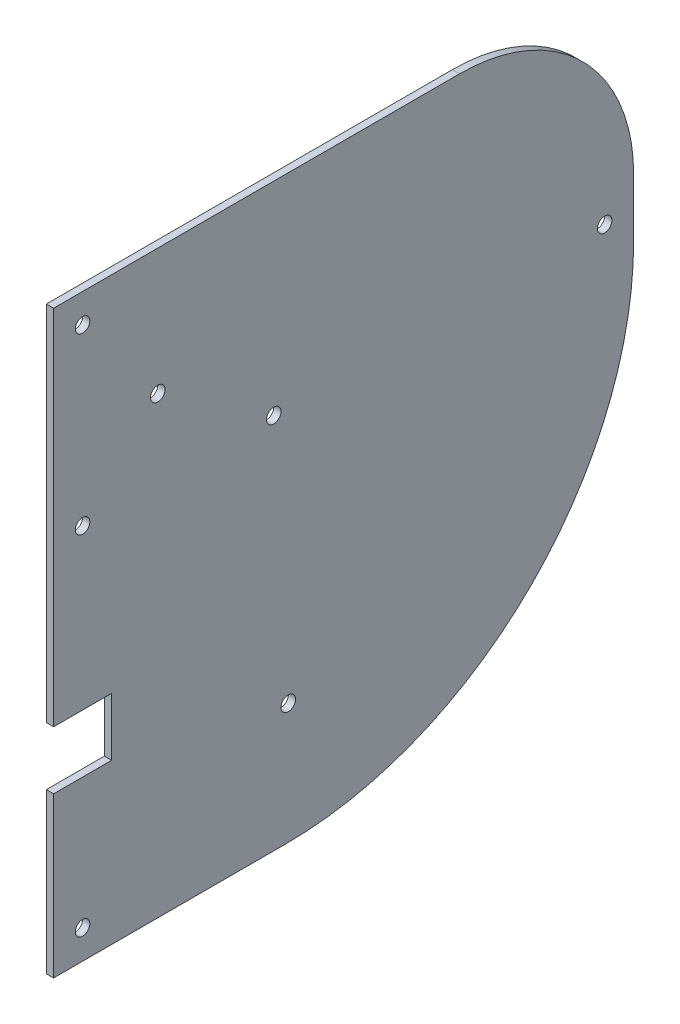
ISO-10303-21;
HEADER;
FILE_DESCRIPTION(('STEP AP214'),'2;1');
FILE_NAME('part.step','',(''),(''),'','','');
FILE_SCHEMA(('AUTOMOTIVE_DESIGN { 1 0 10303 214 1 1 1 1 }'));
ENDSEC;
DATA;
#1=APPLICATION_CONTEXT('core data for automotive mechanical design processes');
#2=APPLICATION_PROTOCOL_DEFINITION('international standard','automotive_design',2000,#1);
#3=PRODUCT_CONTEXT('',#1,'mechanical');
#4=PRODUCT('Part','Part','',(#3));
#5=PRODUCT_RELATED_PRODUCT_CATEGORY('part','',(#4));
#6=PRODUCT_DEFINITION_FORMATION('','',#4);
#7=PRODUCT_DEFINITION_CONTEXT('part definition',#1,'design');
#8=PRODUCT_DEFINITION('design','',#6,#7);
#9=PRODUCT_DEFINITION_SHAPE('','',#8);
#10=(LENGTH_UNIT() NAMED_UNIT(*) SI_UNIT(.MILLI.,.METRE.));
#11=(NAMED_UNIT(*) PLANE_ANGLE_UNIT() SI_UNIT($,.RADIAN.));
#12=(NAMED_UNIT(*) SI_UNIT($,.STERADIAN.) SOLID_ANGLE_UNIT());
#13=UNCERTAINTY_MEASURE_WITH_UNIT(LENGTH_MEASURE(1.E-05),#10,'distance_accuracy_value','');
#14=(GEOMETRIC_REPRESENTATION_CONTEXT(3) GLOBAL_UNCERTAINTY_ASSIGNED_CONTEXT((#13)) GLOBAL_UNIT_ASSIGNED_CONTEXT((#10,
#11,#12)) REPRESENTATION_CONTEXT('',''));
#15=CARTESIAN_POINT('',(0.,0.,0.));
#16=DIRECTION('',(0.,0.,1.));
#17=DIRECTION('',(1.,0.,0.));
#18=AXIS2_PLACEMENT_3D('',#15,#16,#17);
#19=CARTESIAN_POINT('',(3.175,0.,0.));
#20=DIRECTION('',(0.,0.,-1.));
#21=DIRECTION('',(-1.,0.,0.));
#22=AXIS2_PLACEMENT_3D('',#19,#20,#21);
#23=PLANE('',#22);
#24=DIRECTION('',(0.,-1.,0.));
#25=VECTOR('',#24,1.);
#26=CARTESIAN_POINT('',(0.,0.,0.));
#27=LINE('',#26,#25);
#28=CARTESIAN_POINT('',(0.,254.,0.));
#29=VERTEX_POINT('',#28);
#30=CARTESIAN_POINT('',(0.,95.25,0.));
#31=VERTEX_POINT('',#30);
#32=EDGE_CURVE('E134',#29,#31,#27,.T.);
#33=ORIENTED_EDGE('',*,*,#32,.T.);
#34=DIRECTION('',(1.,0.,0.));
#35=VECTOR('',#34,1.);
#36=CARTESIAN_POINT('',(0.,95.25,0.));
#37=LINE('',#36,#35);
#38=CARTESIAN_POINT('',(3.175,95.25,0.));
#39=VERTEX_POINT('',#38);
#40=EDGE_CURVE('E135',#31,#39,#37,.T.);
#41=ORIENTED_EDGE('',*,*,#40,.T.);
#42=DIRECTION('',(0.,-1.,0.));
#43=VECTOR('',#42,1.);
#44=CARTESIAN_POINT('',(3.175,0.,0.));
#45=LINE('',#44,#43);
#46=CARTESIAN_POINT('',(3.175,254.,0.));
#47=VERTEX_POINT('',#46);
#48=EDGE_CURVE('E180',#47,#39,#45,.T.);
#49=ORIENTED_EDGE('',*,*,#48,.F.);
#50=DIRECTION('',(-1.,0.,0.));
#51=VECTOR('',#50,1.);
#52=CARTESIAN_POINT('',(3.175,254.,0.));
#53=LINE('',#52,#51);
#54=EDGE_CURVE('E150',#47,#29,#53,.T.);
#55=ORIENTED_EDGE('',*,*,#54,.T.);
#56=EDGE_LOOP('',(#33,#41,#49,#55));
#57=FACE_BOUND('',#56,.T.);
#58=ADVANCED_FACE('F32',(#57),#23,.F.);
#59=CARTESIAN_POINT('',(3.175,69.85,0.));
#60=VERTEX_POINT('',#59);
#61=CARTESIAN_POINT('',(3.175,0.,0.));
#62=VERTEX_POINT('',#61);
#63=EDGE_CURVE('E127',#60,#62,#45,.T.);
#64=ORIENTED_EDGE('',*,*,#63,.F.);
#65=DIRECTION('',(1.,0.,0.));
#66=VECTOR('',#65,1.);
#67=CARTESIAN_POINT('',(0.,69.85,0.));
#68=LINE('',#67,#66);
#69=CARTESIAN_POINT('',(0.,69.85,0.));
#70=VERTEX_POINT('',#69);
#71=EDGE_CURVE('E113',#70,#60,#68,.T.);
#72=ORIENTED_EDGE('',*,*,#71,.F.);
#73=CARTESIAN_POINT('',(0.,0.,0.));
#74=VERTEX_POINT('',#73);
#75=EDGE_CURVE('E125',#70,#74,#27,.T.);
#76=ORIENTED_EDGE('',*,*,#75,.T.);
#77=DIRECTION('',(-1.,0.,0.));
#78=VECTOR('',#77,1.);
#79=CARTESIAN_POINT('',(3.175,0.,0.));
#80=LINE('',#79,#78);
#81=EDGE_CURVE('E153',#62,#74,#80,.T.);
#82=ORIENTED_EDGE('',*,*,#81,.F.);
#83=EDGE_LOOP('',(#64,#72,#76,#82));
#84=FACE_BOUND('',#83,.T.);
#85=ADVANCED_FACE('F123',(#84),#23,.F.);
#86=CARTESIAN_POINT('',(3.175,0.,0.));
#87=DIRECTION('',(0.,1.,0.));
#88=DIRECTION('',(0.,0.,1.));
#89=AXIS2_PLACEMENT_3D('',#86,#87,#88);
#90=PLANE('',#89);
#91=DIRECTION('',(0.,0.,-1.));
#92=VECTOR('',#91,1.);
#93=CARTESIAN_POINT('',(0.,0.,0.));
#94=LINE('',#93,#92);
#95=CARTESIAN_POINT('',(0.,0.,-101.6));
#96=VERTEX_POINT('',#95);
#97=EDGE_CURVE('E132',#74,#96,#94,.T.);
#98=ORIENTED_EDGE('',*,*,#97,.T.);
#99=DIRECTION('',(-1.,0.,0.));
#100=VECTOR('',#99,1.);
#101=CARTESIAN_POINT('',(3.175,0.,-101.6));
#102=LINE('',#101,#100);
#103=CARTESIAN_POINT('',(3.175,0.,-101.6));
#104=VERTEX_POINT('',#103);
#105=EDGE_CURVE('E160',#96,#104,#102,.F.);
#106=ORIENTED_EDGE('',*,*,#105,.T.);
#107=DIRECTION('',(0.,0.,-1.));
#108=VECTOR('',#107,1.);
#109=CARTESIAN_POINT('',(3.175,0.,0.));
#110=LINE('',#109,#108);
#111=EDGE_CURVE('E183',#62,#104,#110,.T.);
#112=ORIENTED_EDGE('',*,*,#111,.F.);
#113=ORIENTED_EDGE('',*,*,#81,.T.);
#114=EDGE_LOOP('',(#98,#106,#112,#113));
#115=FACE_BOUND('',#114,.T.);
#116=ADVANCED_FACE('F202',(#115),#90,.F.);
#117=CARTESIAN_POINT('',(3.175,0.,-254.));
#118=DIRECTION('',(0.,0.,1.));
#119=DIRECTION('',(1.,0.,0.));
#120=AXIS2_PLACEMENT_3D('',#117,#118,#119);
#121=PLANE('',#120);
#122=DIRECTION('',(0.,1.,0.));
#123=VECTOR('',#122,1.);
#124=CARTESIAN_POINT('',(0.,0.,-254.));
#125=LINE('',#124,#123);
#126=CARTESIAN_POINT('',(0.,152.4,-254.));
#127=VERTEX_POINT('',#126);
#128=CARTESIAN_POINT('',(0.,177.8,-254.));
#129=VERTEX_POINT('',#128);
#130=EDGE_CURVE('E146',#127,#129,#125,.T.);
#131=ORIENTED_EDGE('',*,*,#130,.T.);
#132=DIRECTION('',(-1.,0.,0.));
#133=VECTOR('',#132,1.);
#134=CARTESIAN_POINT('',(3.175,177.8,-254.));
#135=LINE('',#134,#133);
#136=CARTESIAN_POINT('',(3.175,177.8,-254.));
#137=VERTEX_POINT('',#136);
#138=EDGE_CURVE('E40',#129,#137,#135,.F.);
#139=ORIENTED_EDGE('',*,*,#138,.T.);
#140=DIRECTION('',(0.,1.,0.));
#141=VECTOR('',#140,1.);
#142=CARTESIAN_POINT('',(3.175,0.,-254.));
#143=LINE('',#142,#141);
#144=CARTESIAN_POINT('',(3.175,152.4,-254.));
#145=VERTEX_POINT('',#144);
#146=EDGE_CURVE('E186',#145,#137,#143,.T.);
#147=ORIENTED_EDGE('',*,*,#146,.F.);
#148=DIRECTION('',(-1.,0.,0.));
#149=VECTOR('',#148,1.);
#150=CARTESIAN_POINT('',(3.175,152.4,-254.));
#151=LINE('',#150,#149);
#152=EDGE_CURVE('E155',#145,#127,#151,.T.);
#153=ORIENTED_EDGE('',*,*,#152,.T.);
#154=EDGE_LOOP('',(#131,#139,#147,#153));
#155=FACE_BOUND('',#154,.T.);
#156=ADVANCED_FACE('F206',(#155),#121,.F.);
#157=CARTESIAN_POINT('',(3.175,254.,0.));
#158=DIRECTION('',(0.,-1.,0.));
#159=DIRECTION('',(0.,0.,-1.));
#160=AXIS2_PLACEMENT_3D('',#157,#158,#159);
#161=PLANE('',#160);
#162=DIRECTION('',(0.,0.,1.));
#163=VECTOR('',#162,1.);
#164=CARTESIAN_POINT('',(3.175,254.,0.));
#165=LINE('',#164,#163);
#166=CARTESIAN_POINT('',(3.175,254.,-177.8));
#167=VERTEX_POINT('',#166);
#168=EDGE_CURVE('E143',#167,#47,#165,.T.);
#169=ORIENTED_EDGE('',*,*,#168,.F.);
#170=DIRECTION('',(-1.,0.,0.));
#171=VECTOR('',#170,1.);
#172=CARTESIAN_POINT('',(3.175,254.,-177.8));
#173=LINE('',#172,#171);
#174=CARTESIAN_POINT('',(0.,254.,-177.8));
#175=VERTEX_POINT('',#174);
#176=EDGE_CURVE('E164',#167,#175,#173,.T.);
#177=ORIENTED_EDGE('',*,*,#176,.T.);
#178=DIRECTION('',(0.,0.,1.));
#179=VECTOR('',#178,1.);
#180=CARTESIAN_POINT('',(0.,254.,0.));
#181=LINE('',#180,#179);
#182=EDGE_CURVE('E148',#175,#29,#181,.T.);
#183=ORIENTED_EDGE('',*,*,#182,.T.);
#184=ORIENTED_EDGE('',*,*,#54,.F.);
#185=EDGE_LOOP('',(#169,#177,#183,#184));
#186=FACE_BOUND('',#185,.T.);
#187=ADVANCED_FACE('F170',(#186),#161,.F.);
#188=CARTESIAN_POINT('',(3.175,0.,0.));
#189=DIRECTION('',(-1.,0.,0.));
#190=DIRECTION('',(0.,0.,1.));
#191=AXIS2_PLACEMENT_3D('',#188,#189,#190);
#192=PLANE('',#191);
#193=CARTESIAN_POINT('',(3.175,165.1,-12.7));
#194=DIRECTION('',(1.,0.,0.));
#195=DIRECTION('',(0.,0.,-1.));
#196=AXIS2_PLACEMENT_3D('',#193,#194,#195);
#197=CIRCLE('',#196,3.175);
#198=CARTESIAN_POINT('',(3.175,165.1,-15.875));
#199=VERTEX_POINT('',#198);
#200=EDGE_CURVE('E278',#199,#199,#197,.T.);
#201=ORIENTED_EDGE('',*,*,#200,.F.);
#202=EDGE_LOOP('',(#201));
#203=FACE_BOUND('',#202,.T.);
#204=CARTESIAN_POINT('',(3.175,12.7,-12.7));
#205=DIRECTION('',(1.,0.,0.));
#206=DIRECTION('',(0.,0.,-1.));
#207=AXIS2_PLACEMENT_3D('',#204,#205,#206);
#208=CIRCLE('',#207,3.175);
#209=CARTESIAN_POINT('',(3.175,12.7,-15.875));
#210=VERTEX_POINT('',#209);
#211=EDGE_CURVE('E266',#210,#210,#208,.T.);
#212=ORIENTED_EDGE('',*,*,#211,.F.);
#213=EDGE_LOOP('',(#212));
#214=FACE_BOUND('',#213,.T.);
#215=CARTESIAN_POINT('',(3.175,241.3,-12.7));
#216=DIRECTION('',(1.,0.,0.));
#217=DIRECTION('',(0.,0.,-1.));
#218=AXIS2_PLACEMENT_3D('',#215,#216,#217);
#219=CIRCLE('',#218,3.175);
#220=CARTESIAN_POINT('',(3.175,241.3,-15.875));
#221=VERTEX_POINT('',#220);
#222=EDGE_CURVE('E262',#221,#221,#219,.T.);
#223=ORIENTED_EDGE('',*,*,#222,.F.);
#224=EDGE_LOOP('',(#223));
#225=FACE_BOUND('',#224,.T.);
#226=CARTESIAN_POINT('',(3.175,165.1,-241.3));
#227=DIRECTION('',(1.,0.,0.));
#228=DIRECTION('',(0.,0.,-1.));
#229=AXIS2_PLACEMENT_3D('',#226,#227,#228);
#230=CIRCLE('',#229,3.17499999999997);
#231=CARTESIAN_POINT('',(3.175,165.1,-244.475));
#232=VERTEX_POINT('',#231);
#233=EDGE_CURVE('E269',#232,#232,#230,.T.);
#234=ORIENTED_EDGE('',*,*,#233,.F.);
#235=EDGE_LOOP('',(#234));
#236=FACE_BOUND('',#235,.T.);
#237=CARTESIAN_POINT('',(3.175,198.824999999982,-45.6250000000001));
#238=DIRECTION('',(1.,0.,0.));
#239=DIRECTION('',(0.,0.,-1.));
#240=AXIS2_PLACEMENT_3D('',#237,#238,#239);
#241=CIRCLE('',#240,3.175);
#242=CARTESIAN_POINT('',(3.175,198.824999999982,-48.8000000000001));
#243=VERTEX_POINT('',#242);
#244=EDGE_CURVE('E277',#243,#243,#241,.T.);
#245=ORIENTED_EDGE('',*,*,#244,.F.);
#246=EDGE_LOOP('',(#245));
#247=FACE_BOUND('',#246,.T.);
#248=CARTESIAN_POINT('',(3.175,165.100000139982,-96.4250000000001));
#249=DIRECTION('',(1.,0.,0.));
#250=DIRECTION('',(0.,0.,-1.));
#251=AXIS2_PLACEMENT_3D('',#248,#249,#250);
#252=CIRCLE('',#251,3.17500000000002);
#253=CARTESIAN_POINT('',(3.175,165.100000139982,-99.6000000000002));
#254=VERTEX_POINT('',#253);
#255=EDGE_CURVE('E296',#254,#254,#252,.T.);
#256=ORIENTED_EDGE('',*,*,#255,.F.);
#257=EDGE_LOOP('',(#256));
#258=FACE_BOUND('',#257,.T.);
#259=CARTESIAN_POINT('',(3.175,52.7749999999818,-102.775));
#260=DIRECTION('',(1.,0.,0.));
#261=DIRECTION('',(0.,0.,-1.));
#262=AXIS2_PLACEMENT_3D('',#259,#260,#261);
#263=CIRCLE('',#262,3.175);
#264=CARTESIAN_POINT('',(3.175,52.7749999999818,-105.95));
#265=VERTEX_POINT('',#264);
#266=EDGE_CURVE('E290',#265,#265,#263,.T.);
#267=ORIENTED_EDGE('',*,*,#266,.F.);
#268=EDGE_LOOP('',(#267));
#269=FACE_BOUND('',#268,.T.);
#270=ORIENTED_EDGE('',*,*,#146,.T.);
#271=CARTESIAN_POINT('',(3.175,177.8,-177.8));
#272=DIRECTION('',(-1.,0.,0.));
#273=DIRECTION('',(0.,0.,1.));
#274=AXIS2_PLACEMENT_3D('',#271,#272,#273);
#275=CIRCLE('',#274,76.2);
#276=EDGE_CURVE('E11',#137,#167,#275,.F.);
#277=ORIENTED_EDGE('',*,*,#276,.T.);
#278=ORIENTED_EDGE('',*,*,#168,.T.);
#279=ORIENTED_EDGE('',*,*,#48,.T.);
#280=DIRECTION('',(0.,0.,1.));
#281=VECTOR('',#280,1.);
#282=CARTESIAN_POINT('',(3.175,95.25,0.));
#283=LINE('',#282,#281);
#284=CARTESIAN_POINT('',(3.175,95.25,-25.4));
#285=VERTEX_POINT('',#284);
#286=EDGE_CURVE('E119',#285,#39,#283,.T.);
#287=ORIENTED_EDGE('',*,*,#286,.F.);
#288=DIRECTION('',(0.,1.,0.));
#289=VECTOR('',#288,1.);
#290=CARTESIAN_POINT('',(3.175,95.25,-25.4));
#291=LINE('',#290,#289);
#292=CARTESIAN_POINT('',(3.175,69.85,-25.4));
#293=VERTEX_POINT('',#292);
#294=EDGE_CURVE('E307',#293,#285,#291,.T.);
#295=ORIENTED_EDGE('',*,*,#294,.F.);
#296=DIRECTION('',(0.,0.,-1.));
#297=VECTOR('',#296,1.);
#298=CARTESIAN_POINT('',(3.175,69.85,0.));
#299=LINE('',#298,#297);
#300=EDGE_CURVE('E289',#60,#293,#299,.T.);
#301=ORIENTED_EDGE('',*,*,#300,.F.);
#302=ORIENTED_EDGE('',*,*,#63,.T.);
#303=ORIENTED_EDGE('',*,*,#111,.T.);
#304=CARTESIAN_POINT('',(3.175,152.4,-101.6));
#305=DIRECTION('',(-1.,0.,0.));
#306=DIRECTION('',(0.,0.,1.));
#307=AXIS2_PLACEMENT_3D('',#304,#305,#306);
#308=CIRCLE('',#307,152.4);
#309=EDGE_CURVE('E162',#104,#145,#308,.F.);
#310=ORIENTED_EDGE('',*,*,#309,.T.);
#311=EDGE_LOOP('',(#270,#277,#278,#279,#287,#295,#301,#302,#303,#310));
#312=FACE_BOUND('',#311,.T.);
#313=ADVANCED_FACE('F189',(#203,#214,#225,#236,#247,#258,#269,#312),#192,.F.);
#314=CARTESIAN_POINT('',(0.,0.,0.));
#315=DIRECTION('',(-1.,0.,0.));
#316=DIRECTION('',(0.,0.,1.));
#317=AXIS2_PLACEMENT_3D('',#314,#315,#316);
#318=PLANE('',#317);
#319=CARTESIAN_POINT('',(0.,165.1,-12.7));
#320=DIRECTION('',(1.,0.,0.));
#321=DIRECTION('',(0.,0.,-1.));
#322=AXIS2_PLACEMENT_3D('',#319,#320,#321);
#323=CIRCLE('',#322,3.175);
#324=CARTESIAN_POINT('',(0.,165.1,-15.875));
#325=VERTEX_POINT('',#324);
#326=EDGE_CURVE('E274',#325,#325,#323,.T.);
#327=ORIENTED_EDGE('',*,*,#326,.T.);
#328=EDGE_LOOP('',(#327));
#329=FACE_BOUND('',#328,.T.);
#330=CARTESIAN_POINT('',(0.,12.7,-12.7));
#331=DIRECTION('',(1.,0.,0.));
#332=DIRECTION('',(0.,0.,-1.));
#333=AXIS2_PLACEMENT_3D('',#330,#331,#332);
#334=CIRCLE('',#333,3.175);
#335=CARTESIAN_POINT('',(0.,12.7,-15.875));
#336=VERTEX_POINT('',#335);
#337=EDGE_CURVE('E281',#336,#336,#334,.T.);
#338=ORIENTED_EDGE('',*,*,#337,.T.);
#339=EDGE_LOOP('',(#338));
#340=FACE_BOUND('',#339,.T.);
#341=CARTESIAN_POINT('',(0.,241.3,-12.7));
#342=DIRECTION('',(1.,0.,0.));
#343=DIRECTION('',(0.,0.,-1.));
#344=AXIS2_PLACEMENT_3D('',#341,#342,#343);
#345=CIRCLE('',#344,3.175);
#346=CARTESIAN_POINT('',(0.,241.3,-15.875));
#347=VERTEX_POINT('',#346);
#348=EDGE_CURVE('E259',#347,#347,#345,.T.);
#349=ORIENTED_EDGE('',*,*,#348,.T.);
#350=EDGE_LOOP('',(#349));
#351=FACE_BOUND('',#350,.T.);
#352=CARTESIAN_POINT('',(0.,165.1,-241.3));
#353=DIRECTION('',(1.,0.,0.));
#354=DIRECTION('',(0.,0.,-1.));
#355=AXIS2_PLACEMENT_3D('',#352,#353,#354);
#356=CIRCLE('',#355,3.17499999999997);
#357=CARTESIAN_POINT('',(0.,165.1,-244.475));
#358=VERTEX_POINT('',#357);
#359=EDGE_CURVE('E264',#358,#358,#356,.T.);
#360=ORIENTED_EDGE('',*,*,#359,.T.);
#361=EDGE_LOOP('',(#360));
#362=FACE_BOUND('',#361,.T.);
#363=CARTESIAN_POINT('',(0.,198.824999999982,-45.6250000000001));
#364=DIRECTION('',(1.,0.,0.));
#365=DIRECTION('',(0.,0.,-1.));
#366=AXIS2_PLACEMENT_3D('',#363,#364,#365);
#367=CIRCLE('',#366,3.175);
#368=CARTESIAN_POINT('',(0.,198.824999999982,-48.8000000000001));
#369=VERTEX_POINT('',#368);
#370=EDGE_CURVE('E299',#369,#369,#367,.T.);
#371=ORIENTED_EDGE('',*,*,#370,.T.);
#372=EDGE_LOOP('',(#371));
#373=FACE_BOUND('',#372,.T.);
#374=CARTESIAN_POINT('',(0.,165.100000139982,-96.4250000000001));
#375=DIRECTION('',(1.,0.,0.));
#376=DIRECTION('',(0.,0.,-1.));
#377=AXIS2_PLACEMENT_3D('',#374,#375,#376);
#378=CIRCLE('',#377,3.17500000000002);
#379=CARTESIAN_POINT('',(0.,165.100000139982,-99.6000000000002));
#380=VERTEX_POINT('',#379);
#381=EDGE_CURVE('E293',#380,#380,#378,.T.);
#382=ORIENTED_EDGE('',*,*,#381,.T.);
#383=EDGE_LOOP('',(#382));
#384=FACE_BOUND('',#383,.T.);
#385=CARTESIAN_POINT('',(0.,52.7749999999818,-102.775));
#386=DIRECTION('',(1.,0.,0.));
#387=DIRECTION('',(0.,0.,-1.));
#388=AXIS2_PLACEMENT_3D('',#385,#386,#387);
#389=CIRCLE('',#388,3.175);
#390=CARTESIAN_POINT('',(0.,52.7749999999818,-105.95));
#391=VERTEX_POINT('',#390);
#392=EDGE_CURVE('E286',#391,#391,#389,.T.);
#393=ORIENTED_EDGE('',*,*,#392,.T.);
#394=EDGE_LOOP('',(#393));
#395=FACE_BOUND('',#394,.T.);
#396=ORIENTED_EDGE('',*,*,#182,.F.);
#397=CARTESIAN_POINT('',(0.,177.8,-177.8));
#398=DIRECTION('',(-1.,0.,0.));
#399=DIRECTION('',(0.,0.,1.));
#400=AXIS2_PLACEMENT_3D('',#397,#398,#399);
#401=CIRCLE('',#400,76.2);
#402=EDGE_CURVE('E54',#175,#129,#401,.T.);
#403=ORIENTED_EDGE('',*,*,#402,.T.);
#404=ORIENTED_EDGE('',*,*,#130,.F.);
#405=CARTESIAN_POINT('',(0.,152.4,-101.6));
#406=DIRECTION('',(-1.,0.,0.));
#407=DIRECTION('',(0.,0.,1.));
#408=AXIS2_PLACEMENT_3D('',#405,#406,#407);
#409=CIRCLE('',#408,152.4);
#410=EDGE_CURVE('E158',#127,#96,#409,.T.);
#411=ORIENTED_EDGE('',*,*,#410,.T.);
#412=ORIENTED_EDGE('',*,*,#97,.F.);
#413=ORIENTED_EDGE('',*,*,#75,.F.);
#414=DIRECTION('',(0.,0.,-1.));
#415=VECTOR('',#414,1.);
#416=CARTESIAN_POINT('',(0.,69.85,0.));
#417=LINE('',#416,#415);
#418=CARTESIAN_POINT('',(0.,69.85,-25.4));
#419=VERTEX_POINT('',#418);
#420=EDGE_CURVE('E109',#70,#419,#417,.T.);
#421=ORIENTED_EDGE('',*,*,#420,.T.);
#422=DIRECTION('',(0.,1.,0.));
#423=VECTOR('',#422,1.);
#424=CARTESIAN_POINT('',(0.,95.25,-25.4));
#425=LINE('',#424,#423);
#426=CARTESIAN_POINT('',(0.,95.25,-25.4));
#427=VERTEX_POINT('',#426);
#428=EDGE_CURVE('E118',#419,#427,#425,.T.);
#429=ORIENTED_EDGE('',*,*,#428,.T.);
#430=DIRECTION('',(0.,0.,1.));
#431=VECTOR('',#430,1.);
#432=CARTESIAN_POINT('',(0.,95.25,0.));
#433=LINE('',#432,#431);
#434=EDGE_CURVE('E128',#427,#31,#433,.T.);
#435=ORIENTED_EDGE('',*,*,#434,.T.);
#436=ORIENTED_EDGE('',*,*,#32,.F.);
#437=EDGE_LOOP('',(#396,#403,#404,#411,#412,#413,#421,#429,#435,#436));
#438=FACE_BOUND('',#437,.T.);
#439=ADVANCED_FACE('F130',(#329,#340,#351,#362,#373,#384,#395,#438),#318,.T.);
#440=CARTESIAN_POINT('',(0.,95.25,0.));
#441=DIRECTION('',(0.,1.,0.));
#442=DIRECTION('',(0.,0.,1.));
#443=AXIS2_PLACEMENT_3D('',#440,#441,#442);
#444=PLANE('',#443);
#445=ORIENTED_EDGE('',*,*,#286,.T.);
#446=ORIENTED_EDGE('',*,*,#40,.F.);
#447=ORIENTED_EDGE('',*,*,#434,.F.);
#448=DIRECTION('',(1.,0.,0.));
#449=VECTOR('',#448,1.);
#450=CARTESIAN_POINT('',(0.,95.25,-25.4));
#451=LINE('',#450,#449);
#452=EDGE_CURVE('E139',#427,#285,#451,.T.);
#453=ORIENTED_EDGE('',*,*,#452,.T.);
#454=EDGE_LOOP('',(#445,#446,#447,#453));
#455=FACE_BOUND('',#454,.T.);
#456=ADVANCED_FACE('F214',(#455),#444,.F.);
#457=CARTESIAN_POINT('',(0.,95.25,-25.4));
#458=DIRECTION('',(0.,0.,-1.));
#459=DIRECTION('',(0.,1.,0.));
#460=AXIS2_PLACEMENT_3D('',#457,#458,#459);
#461=PLANE('',#460);
#462=ORIENTED_EDGE('',*,*,#294,.T.);
#463=ORIENTED_EDGE('',*,*,#452,.F.);
#464=ORIENTED_EDGE('',*,*,#428,.F.);
#465=DIRECTION('',(1.,0.,0.));
#466=VECTOR('',#465,1.);
#467=CARTESIAN_POINT('',(0.,69.85,-25.4));
#468=LINE('',#467,#466);
#469=EDGE_CURVE('E115',#419,#293,#468,.T.);
#470=ORIENTED_EDGE('',*,*,#469,.T.);
#471=EDGE_LOOP('',(#462,#463,#464,#470));
#472=FACE_BOUND('',#471,.T.);
#473=ADVANCED_FACE('F222',(#472),#461,.F.);
#474=CARTESIAN_POINT('',(0.,69.85,0.));
#475=DIRECTION('',(0.,-1.,0.));
#476=DIRECTION('',(0.,0.,-1.));
#477=AXIS2_PLACEMENT_3D('',#474,#475,#476);
#478=PLANE('',#477);
#479=ORIENTED_EDGE('',*,*,#300,.T.);
#480=ORIENTED_EDGE('',*,*,#469,.F.);
#481=ORIENTED_EDGE('',*,*,#420,.F.);
#482=ORIENTED_EDGE('',*,*,#71,.T.);
#483=EDGE_LOOP('',(#479,#480,#481,#482));
#484=FACE_BOUND('',#483,.T.);
#485=ADVANCED_FACE('F112',(#484),#478,.F.);
#486=CARTESIAN_POINT('',(0.,52.7749999999818,-102.775));
#487=DIRECTION('',(1.,0.,0.));
#488=DIRECTION('',(0.,0.,-1.));
#489=AXIS2_PLACEMENT_3D('',#486,#487,#488);
#490=CYLINDRICAL_SURFACE('',#489,3.175);
#491=ORIENTED_EDGE('',*,*,#392,.F.);
#492=EDGE_LOOP('',(#491));
#493=FACE_BOUND('',#492,.T.);
#494=ORIENTED_EDGE('',*,*,#266,.T.);
#495=EDGE_LOOP('',(#494));
#496=FACE_BOUND('',#495,.T.);
#497=ADVANCED_FACE('F221',(#493,#496),#490,.F.);
#498=CARTESIAN_POINT('',(0.,165.100000139982,-96.4250000000001));
#499=DIRECTION('',(1.,0.,0.));
#500=DIRECTION('',(0.,0.,-1.));
#501=AXIS2_PLACEMENT_3D('',#498,#499,#500);
#502=CYLINDRICAL_SURFACE('',#501,3.17500000000002);
#503=ORIENTED_EDGE('',*,*,#381,.F.);
#504=EDGE_LOOP('',(#503));
#505=FACE_BOUND('',#504,.T.);
#506=ORIENTED_EDGE('',*,*,#255,.T.);
#507=EDGE_LOOP('',(#506));
#508=FACE_BOUND('',#507,.T.);
#509=ADVANCED_FACE('F233',(#505,#508),#502,.F.);
#510=CARTESIAN_POINT('',(0.,198.824999999982,-45.6250000000001));
#511=DIRECTION('',(1.,0.,0.));
#512=DIRECTION('',(0.,0.,-1.));
#513=AXIS2_PLACEMENT_3D('',#510,#511,#512);
#514=CYLINDRICAL_SURFACE('',#513,3.175);
#515=ORIENTED_EDGE('',*,*,#370,.F.);
#516=EDGE_LOOP('',(#515));
#517=FACE_BOUND('',#516,.T.);
#518=ORIENTED_EDGE('',*,*,#244,.T.);
#519=EDGE_LOOP('',(#518));
#520=FACE_BOUND('',#519,.T.);
#521=ADVANCED_FACE('F229',(#517,#520),#514,.F.);
#522=CARTESIAN_POINT('',(0.,165.1,-241.3));
#523=DIRECTION('',(1.,0.,0.));
#524=DIRECTION('',(0.,0.,-1.));
#525=AXIS2_PLACEMENT_3D('',#522,#523,#524);
#526=CYLINDRICAL_SURFACE('',#525,3.17499999999997);
#527=ORIENTED_EDGE('',*,*,#359,.F.);
#528=EDGE_LOOP('',(#527));
#529=FACE_BOUND('',#528,.T.);
#530=ORIENTED_EDGE('',*,*,#233,.T.);
#531=EDGE_LOOP('',(#530));
#532=FACE_BOUND('',#531,.T.);
#533=ADVANCED_FACE('F232',(#529,#532),#526,.F.);
#534=CARTESIAN_POINT('',(0.,241.3,-12.7));
#535=DIRECTION('',(1.,0.,0.));
#536=DIRECTION('',(0.,0.,-1.));
#537=AXIS2_PLACEMENT_3D('',#534,#535,#536);
#538=CYLINDRICAL_SURFACE('',#537,3.175);
#539=ORIENTED_EDGE('',*,*,#348,.F.);
#540=EDGE_LOOP('',(#539));
#541=FACE_BOUND('',#540,.T.);
#542=ORIENTED_EDGE('',*,*,#222,.T.);
#543=EDGE_LOOP('',(#542));
#544=FACE_BOUND('',#543,.T.);
#545=ADVANCED_FACE('F244',(#541,#544),#538,.F.);
#546=CARTESIAN_POINT('',(0.,12.7,-12.7));
#547=DIRECTION('',(1.,0.,0.));
#548=DIRECTION('',(0.,0.,-1.));
#549=AXIS2_PLACEMENT_3D('',#546,#547,#548);
#550=CYLINDRICAL_SURFACE('',#549,3.175);
#551=ORIENTED_EDGE('',*,*,#337,.F.);
#552=EDGE_LOOP('',(#551));
#553=FACE_BOUND('',#552,.T.);
#554=ORIENTED_EDGE('',*,*,#211,.T.);
#555=EDGE_LOOP('',(#554));
#556=FACE_BOUND('',#555,.T.);
#557=ADVANCED_FACE('F241',(#553,#556),#550,.F.);
#558=CARTESIAN_POINT('',(0.,165.1,-12.7));
#559=DIRECTION('',(1.,0.,0.));
#560=DIRECTION('',(0.,0.,-1.));
#561=AXIS2_PLACEMENT_3D('',#558,#559,#560);
#562=CYLINDRICAL_SURFACE('',#561,3.175);
#563=ORIENTED_EDGE('',*,*,#326,.F.);
#564=EDGE_LOOP('',(#563));
#565=FACE_BOUND('',#564,.T.);
#566=ORIENTED_EDGE('',*,*,#200,.T.);
#567=EDGE_LOOP('',(#566));
#568=FACE_BOUND('',#567,.T.);
#569=ADVANCED_FACE('F195',(#565,#568),#562,.F.);
#570=CARTESIAN_POINT('',(3.175,152.4,-101.6));
#571=DIRECTION('',(-1.,0.,0.));
#572=DIRECTION('',(0.,0.,1.));
#573=AXIS2_PLACEMENT_3D('',#570,#571,#572);
#574=CYLINDRICAL_SURFACE('',#573,152.4);
#575=ORIENTED_EDGE('',*,*,#309,.F.);
#576=ORIENTED_EDGE('',*,*,#105,.F.);
#577=ORIENTED_EDGE('',*,*,#410,.F.);
#578=ORIENTED_EDGE('',*,*,#152,.F.);
#579=EDGE_LOOP('',(#575,#576,#577,#578));
#580=FACE_BOUND('',#579,.T.);
#581=ADVANCED_FACE('F191',(#580),#574,.T.);
#582=CARTESIAN_POINT('',(3.175,177.8,-177.8));
#583=DIRECTION('',(-1.,0.,0.));
#584=DIRECTION('',(0.,0.,1.));
#585=AXIS2_PLACEMENT_3D('',#582,#583,#584);
#586=CYLINDRICAL_SURFACE('',#585,76.2);
#587=ORIENTED_EDGE('',*,*,#276,.F.);
#588=ORIENTED_EDGE('',*,*,#138,.F.);
#589=ORIENTED_EDGE('',*,*,#402,.F.);
#590=ORIENTED_EDGE('',*,*,#176,.F.);
#591=EDGE_LOOP('',(#587,#588,#589,#590));
#592=FACE_BOUND('',#591,.T.);
#593=ADVANCED_FACE('F34',(#592),#586,.T.);
#594=CLOSED_SHELL('',(#58,#85,#116,#156,#187,#313,#439,#456,#473,#485,#497,#509,#521,#533,#545,
#557,#569,#581,#593));
#595=MANIFOLD_SOLID_BREP('B2',#594);
#596=ADVANCED_BREP_SHAPE_REPRESENTATION('',(#18,#595),#14);
#597=SHAPE_DEFINITION_REPRESENTATION(#9,#596);
ENDSEC;
END-ISO-10303-21;
